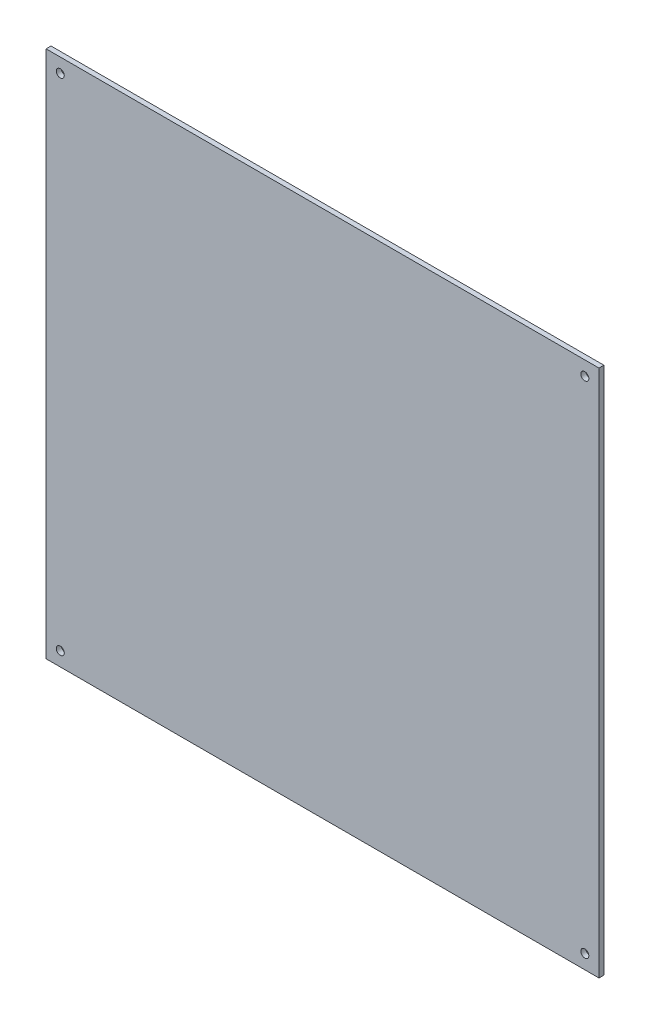
ISO-10303-21;
HEADER;
FILE_DESCRIPTION(('STEP AP214'),'2;1');
FILE_NAME('part.step','',(''),(''),'','','');
FILE_SCHEMA(('AUTOMOTIVE_DESIGN { 1 0 10303 214 1 1 1 1 }'));
ENDSEC;
DATA;
#1=APPLICATION_CONTEXT('core data for automotive mechanical design processes');
#2=APPLICATION_PROTOCOL_DEFINITION('international standard','automotive_design',2000,#1);
#3=PRODUCT_CONTEXT('',#1,'mechanical');
#4=PRODUCT('Part','Part','',(#3));
#5=PRODUCT_RELATED_PRODUCT_CATEGORY('part','',(#4));
#6=PRODUCT_DEFINITION_FORMATION('','',#4);
#7=PRODUCT_DEFINITION_CONTEXT('part definition',#1,'design');
#8=PRODUCT_DEFINITION('design','',#6,#7);
#9=PRODUCT_DEFINITION_SHAPE('','',#8);
#10=(LENGTH_UNIT() NAMED_UNIT(*) SI_UNIT(.MILLI.,.METRE.));
#11=(NAMED_UNIT(*) PLANE_ANGLE_UNIT() SI_UNIT($,.RADIAN.));
#12=(NAMED_UNIT(*) SI_UNIT($,.STERADIAN.) SOLID_ANGLE_UNIT());
#13=UNCERTAINTY_MEASURE_WITH_UNIT(LENGTH_MEASURE(1.E-05),#10,'distance_accuracy_value','');
#14=(GEOMETRIC_REPRESENTATION_CONTEXT(3) GLOBAL_UNCERTAINTY_ASSIGNED_CONTEXT((#13)) GLOBAL_UNIT_ASSIGNED_CONTEXT((#10,
#11,#12)) REPRESENTATION_CONTEXT('',''));
#15=CARTESIAN_POINT('',(0.,0.,0.));
#16=DIRECTION('',(0.,0.,1.));
#17=DIRECTION('',(1.,0.,0.));
#18=AXIS2_PLACEMENT_3D('',#15,#16,#17);
#19=CARTESIAN_POINT('',(0.,0.,4.));
#20=DIRECTION('',(0.,0.,1.));
#21=DIRECTION('',(1.,0.,0.));
#22=AXIS2_PLACEMENT_3D('',#19,#20,#21);
#23=PLANE('',#22);
#24=CARTESIAN_POINT('',(-437.5,11.5000000000001,4.));
#25=DIRECTION('',(0.,0.,1.));
#26=DIRECTION('',(-1.,0.,0.));
#27=AXIS2_PLACEMENT_3D('',#24,#25,#26);
#28=CIRCLE('',#27,3.24999999999995);
#29=CARTESIAN_POINT('',(-440.75,11.5000000000001,4.));
#30=VERTEX_POINT('',#29);
#31=EDGE_CURVE('E161',#30,#30,#28,.T.);
#32=ORIENTED_EDGE('',*,*,#31,.F.);
#33=EDGE_LOOP('',(#32));
#34=FACE_BOUND('',#33,.T.);
#35=CARTESIAN_POINT('',(-437.5,417.5,4.));
#36=DIRECTION('',(0.,0.,1.));
#37=DIRECTION('',(1.,0.,0.));
#38=AXIS2_PLACEMENT_3D('',#35,#36,#37);
#39=CIRCLE('',#38,3.24999999999995);
#40=CARTESIAN_POINT('',(-434.25,417.5,4.));
#41=VERTEX_POINT('',#40);
#42=EDGE_CURVE('E120',#41,#41,#39,.T.);
#43=ORIENTED_EDGE('',*,*,#42,.F.);
#44=EDGE_LOOP('',(#43));
#45=FACE_BOUND('',#44,.T.);
#46=DIRECTION('',(0.,1.,0.));
#47=VECTOR('',#46,1.);
#48=CARTESIAN_POINT('',(0.,0.,4.));
#49=LINE('',#48,#47);
#50=CARTESIAN_POINT('',(0.,0.,4.));
#51=VERTEX_POINT('',#50);
#52=CARTESIAN_POINT('',(-1.66533453693773E-13,429.,4.));
#53=VERTEX_POINT('',#52);
#54=EDGE_CURVE('E100',#51,#53,#49,.T.);
#55=ORIENTED_EDGE('',*,*,#54,.T.);
#56=DIRECTION('',(-1.,0.,0.));
#57=VECTOR('',#56,1.);
#58=CARTESIAN_POINT('',(-1.66533453693773E-13,429.,4.));
#59=LINE('',#58,#57);
#60=CARTESIAN_POINT('',(-449.,429.,4.));
#61=VERTEX_POINT('',#60);
#62=EDGE_CURVE('E94',#53,#61,#59,.T.);
#63=ORIENTED_EDGE('',*,*,#62,.T.);
#64=DIRECTION('',(0.,-1.,0.));
#65=VECTOR('',#64,1.);
#66=CARTESIAN_POINT('',(-449.,0.,4.));
#67=LINE('',#66,#65);
#68=CARTESIAN_POINT('',(-449.,0.,4.));
#69=VERTEX_POINT('',#68);
#70=EDGE_CURVE('E98',#61,#69,#67,.T.);
#71=ORIENTED_EDGE('',*,*,#70,.T.);
#72=DIRECTION('',(1.,0.,0.));
#73=VECTOR('',#72,1.);
#74=CARTESIAN_POINT('',(0.,0.,4.));
#75=LINE('',#74,#73);
#76=EDGE_CURVE('E63',#69,#51,#75,.T.);
#77=ORIENTED_EDGE('',*,*,#76,.T.);
#78=EDGE_LOOP('',(#55,#63,#71,#77));
#79=FACE_BOUND('',#78,.T.);
#80=CARTESIAN_POINT('',(-11.5000000000001,417.5,4.));
#81=DIRECTION('',(0.,0.,1.));
#82=DIRECTION('',(-1.,0.,0.));
#83=AXIS2_PLACEMENT_3D('',#80,#81,#82);
#84=CIRCLE('',#83,3.25);
#85=CARTESIAN_POINT('',(-14.7500000000001,417.5,4.));
#86=VERTEX_POINT('',#85);
#87=EDGE_CURVE('E142',#86,#86,#84,.T.);
#88=ORIENTED_EDGE('',*,*,#87,.F.);
#89=EDGE_LOOP('',(#88));
#90=FACE_BOUND('',#89,.T.);
#91=CARTESIAN_POINT('',(-11.5000000000001,11.5000000000002,4.));
#92=DIRECTION('',(0.,0.,1.));
#93=DIRECTION('',(1.,0.,0.));
#94=AXIS2_PLACEMENT_3D('',#91,#92,#93);
#95=CIRCLE('',#94,3.25);
#96=CARTESIAN_POINT('',(-8.25000000000012,11.5000000000002,4.));
#97=VERTEX_POINT('',#96);
#98=EDGE_CURVE('E162',#97,#97,#95,.T.);
#99=ORIENTED_EDGE('',*,*,#98,.F.);
#100=EDGE_LOOP('',(#99));
#101=FACE_BOUND('',#100,.T.);
#102=ADVANCED_FACE('F45',(#34,#45,#79,#90,#101),#23,.T.);
#103=CARTESIAN_POINT('',(0.,0.,0.));
#104=DIRECTION('',(0.,0.,1.));
#105=DIRECTION('',(1.,0.,0.));
#106=AXIS2_PLACEMENT_3D('',#103,#104,#105);
#107=PLANE('',#106);
#108=DIRECTION('',(0.,1.,0.));
#109=VECTOR('',#108,1.);
#110=CARTESIAN_POINT('',(0.,0.,0.));
#111=LINE('',#110,#109);
#112=CARTESIAN_POINT('',(0.,0.,0.));
#113=VERTEX_POINT('',#112);
#114=CARTESIAN_POINT('',(-1.66533453693773E-13,429.,0.));
#115=VERTEX_POINT('',#114);
#116=EDGE_CURVE('E116',#113,#115,#111,.T.);
#117=ORIENTED_EDGE('',*,*,#116,.F.);
#118=DIRECTION('',(1.,0.,0.));
#119=VECTOR('',#118,1.);
#120=CARTESIAN_POINT('',(0.,0.,0.));
#121=LINE('',#120,#119);
#122=CARTESIAN_POINT('',(-449.,0.,0.));
#123=VERTEX_POINT('',#122);
#124=EDGE_CURVE('E87',#123,#113,#121,.T.);
#125=ORIENTED_EDGE('',*,*,#124,.F.);
#126=DIRECTION('',(0.,-1.,0.));
#127=VECTOR('',#126,1.);
#128=CARTESIAN_POINT('',(-449.,0.,0.));
#129=LINE('',#128,#127);
#130=CARTESIAN_POINT('',(-449.,429.,0.));
#131=VERTEX_POINT('',#130);
#132=EDGE_CURVE('E81',#131,#123,#129,.T.);
#133=ORIENTED_EDGE('',*,*,#132,.F.);
#134=DIRECTION('',(-1.,0.,0.));
#135=VECTOR('',#134,1.);
#136=CARTESIAN_POINT('',(-1.66533453693773E-13,429.,0.));
#137=LINE('',#136,#135);
#138=EDGE_CURVE('E105',#115,#131,#137,.T.);
#139=ORIENTED_EDGE('',*,*,#138,.F.);
#140=EDGE_LOOP('',(#117,#125,#133,#139));
#141=FACE_BOUND('',#140,.T.);
#142=CARTESIAN_POINT('',(-437.5,417.5,0.));
#143=DIRECTION('',(0.,0.,1.));
#144=DIRECTION('',(1.,0.,0.));
#145=AXIS2_PLACEMENT_3D('',#142,#143,#144);
#146=CIRCLE('',#145,3.24999999999995);
#147=CARTESIAN_POINT('',(-434.25,417.5,0.));
#148=VERTEX_POINT('',#147);
#149=EDGE_CURVE('E138',#148,#148,#146,.T.);
#150=ORIENTED_EDGE('',*,*,#149,.T.);
#151=EDGE_LOOP('',(#150));
#152=FACE_BOUND('',#151,.T.);
#153=CARTESIAN_POINT('',(-11.5000000000001,417.5,0.));
#154=DIRECTION('',(0.,0.,1.));
#155=DIRECTION('',(-1.,0.,0.));
#156=AXIS2_PLACEMENT_3D('',#153,#154,#155);
#157=CIRCLE('',#156,3.25);
#158=CARTESIAN_POINT('',(-14.7500000000001,417.5,0.));
#159=VERTEX_POINT('',#158);
#160=EDGE_CURVE('E147',#159,#159,#157,.T.);
#161=ORIENTED_EDGE('',*,*,#160,.T.);
#162=EDGE_LOOP('',(#161));
#163=FACE_BOUND('',#162,.T.);
#164=CARTESIAN_POINT('',(-437.5,11.5000000000001,0.));
#165=DIRECTION('',(0.,0.,1.));
#166=DIRECTION('',(-1.,0.,0.));
#167=AXIS2_PLACEMENT_3D('',#164,#165,#166);
#168=CIRCLE('',#167,3.24999999999995);
#169=CARTESIAN_POINT('',(-440.75,11.5000000000001,0.));
#170=VERTEX_POINT('',#169);
#171=EDGE_CURVE('E158',#170,#170,#168,.T.);
#172=ORIENTED_EDGE('',*,*,#171,.T.);
#173=EDGE_LOOP('',(#172));
#174=FACE_BOUND('',#173,.T.);
#175=CARTESIAN_POINT('',(-11.5000000000001,11.5000000000002,0.));
#176=DIRECTION('',(0.,0.,1.));
#177=DIRECTION('',(1.,0.,0.));
#178=AXIS2_PLACEMENT_3D('',#175,#176,#177);
#179=CIRCLE('',#178,3.25);
#180=CARTESIAN_POINT('',(-8.25000000000012,11.5000000000002,0.));
#181=VERTEX_POINT('',#180);
#182=EDGE_CURVE('E167',#181,#181,#179,.T.);
#183=ORIENTED_EDGE('',*,*,#182,.T.);
#184=EDGE_LOOP('',(#183));
#185=FACE_BOUND('',#184,.T.);
#186=ADVANCED_FACE('F133',(#141,#152,#163,#174,#185),#107,.F.);
#187=CARTESIAN_POINT('',(0.,0.,4.));
#188=DIRECTION('',(-1.,0.,0.));
#189=DIRECTION('',(0.,-1.,0.));
#190=AXIS2_PLACEMENT_3D('',#187,#188,#189);
#191=PLANE('',#190);
#192=ORIENTED_EDGE('',*,*,#116,.T.);
#193=DIRECTION('',(0.,0.,-1.));
#194=VECTOR('',#193,1.);
#195=CARTESIAN_POINT('',(-1.66533453693773E-13,429.,4.));
#196=LINE('',#195,#194);
#197=EDGE_CURVE('E12',#53,#115,#196,.T.);
#198=ORIENTED_EDGE('',*,*,#197,.F.);
#199=ORIENTED_EDGE('',*,*,#54,.F.);
#200=DIRECTION('',(0.,0.,-1.));
#201=VECTOR('',#200,1.);
#202=CARTESIAN_POINT('',(0.,0.,4.));
#203=LINE('',#202,#201);
#204=EDGE_CURVE('E112',#51,#113,#203,.T.);
#205=ORIENTED_EDGE('',*,*,#204,.T.);
#206=EDGE_LOOP('',(#192,#198,#199,#205));
#207=FACE_BOUND('',#206,.T.);
#208=ADVANCED_FACE('F47',(#207),#191,.F.);
#209=CARTESIAN_POINT('',(-1.66533453693773E-13,429.,4.));
#210=DIRECTION('',(0.,-1.,0.));
#211=DIRECTION('',(1.,0.,0.));
#212=AXIS2_PLACEMENT_3D('',#209,#210,#211);
#213=PLANE('',#212);
#214=ORIENTED_EDGE('',*,*,#138,.T.);
#215=DIRECTION('',(0.,0.,-1.));
#216=VECTOR('',#215,1.);
#217=CARTESIAN_POINT('',(-449.,429.,4.));
#218=LINE('',#217,#216);
#219=EDGE_CURVE('E55',#61,#131,#218,.T.);
#220=ORIENTED_EDGE('',*,*,#219,.F.);
#221=ORIENTED_EDGE('',*,*,#62,.F.);
#222=ORIENTED_EDGE('',*,*,#197,.T.);
#223=EDGE_LOOP('',(#214,#220,#221,#222));
#224=FACE_BOUND('',#223,.T.);
#225=ADVANCED_FACE('F104',(#224),#213,.F.);
#226=CARTESIAN_POINT('',(-449.,0.,4.));
#227=DIRECTION('',(1.,0.,0.));
#228=DIRECTION('',(0.,1.,0.));
#229=AXIS2_PLACEMENT_3D('',#226,#227,#228);
#230=PLANE('',#229);
#231=ORIENTED_EDGE('',*,*,#132,.T.);
#232=DIRECTION('',(0.,0.,-1.));
#233=VECTOR('',#232,1.);
#234=CARTESIAN_POINT('',(-449.,0.,4.));
#235=LINE('',#234,#233);
#236=EDGE_CURVE('E107',#69,#123,#235,.T.);
#237=ORIENTED_EDGE('',*,*,#236,.F.);
#238=ORIENTED_EDGE('',*,*,#70,.F.);
#239=ORIENTED_EDGE('',*,*,#219,.T.);
#240=EDGE_LOOP('',(#231,#237,#238,#239));
#241=FACE_BOUND('',#240,.T.);
#242=ADVANCED_FACE('F108',(#241),#230,.F.);
#243=CARTESIAN_POINT('',(0.,0.,4.));
#244=DIRECTION('',(0.,1.,0.));
#245=DIRECTION('',(-1.,0.,0.));
#246=AXIS2_PLACEMENT_3D('',#243,#244,#245);
#247=PLANE('',#246);
#248=ORIENTED_EDGE('',*,*,#124,.T.);
#249=ORIENTED_EDGE('',*,*,#204,.F.);
#250=ORIENTED_EDGE('',*,*,#76,.F.);
#251=ORIENTED_EDGE('',*,*,#236,.T.);
#252=EDGE_LOOP('',(#248,#249,#250,#251));
#253=FACE_BOUND('',#252,.T.);
#254=ADVANCED_FACE('F130',(#253),#247,.F.);
#255=CARTESIAN_POINT('',(-437.5,417.5,4.));
#256=DIRECTION('',(0.,0.,-1.));
#257=DIRECTION('',(-1.,0.,0.));
#258=AXIS2_PLACEMENT_3D('',#255,#256,#257);
#259=CYLINDRICAL_SURFACE('',#258,3.24999999999995);
#260=ORIENTED_EDGE('',*,*,#42,.T.);
#261=EDGE_LOOP('',(#260));
#262=FACE_BOUND('',#261,.T.);
#263=ORIENTED_EDGE('',*,*,#149,.F.);
#264=EDGE_LOOP('',(#263));
#265=FACE_BOUND('',#264,.T.);
#266=ADVANCED_FACE('F188',(#262,#265),#259,.F.);
#267=CARTESIAN_POINT('',(-11.5000000000001,417.5,4.));
#268=DIRECTION('',(0.,0.,-1.));
#269=DIRECTION('',(-1.,0.,0.));
#270=AXIS2_PLACEMENT_3D('',#267,#268,#269);
#271=CYLINDRICAL_SURFACE('',#270,3.25);
#272=ORIENTED_EDGE('',*,*,#87,.T.);
#273=EDGE_LOOP('',(#272));
#274=FACE_BOUND('',#273,.T.);
#275=ORIENTED_EDGE('',*,*,#160,.F.);
#276=EDGE_LOOP('',(#275));
#277=FACE_BOUND('',#276,.T.);
#278=ADVANCED_FACE('F209',(#274,#277),#271,.F.);
#279=CARTESIAN_POINT('',(-437.5,11.5000000000001,4.));
#280=DIRECTION('',(0.,0.,-1.));
#281=DIRECTION('',(-1.,0.,0.));
#282=AXIS2_PLACEMENT_3D('',#279,#280,#281);
#283=CYLINDRICAL_SURFACE('',#282,3.24999999999995);
#284=ORIENTED_EDGE('',*,*,#31,.T.);
#285=EDGE_LOOP('',(#284));
#286=FACE_BOUND('',#285,.T.);
#287=ORIENTED_EDGE('',*,*,#171,.F.);
#288=EDGE_LOOP('',(#287));
#289=FACE_BOUND('',#288,.T.);
#290=ADVANCED_FACE('F212',(#286,#289),#283,.F.);
#291=CARTESIAN_POINT('',(-11.5000000000001,11.5000000000002,4.));
#292=DIRECTION('',(0.,0.,-1.));
#293=DIRECTION('',(-1.,0.,0.));
#294=AXIS2_PLACEMENT_3D('',#291,#292,#293);
#295=CYLINDRICAL_SURFACE('',#294,3.25);
#296=ORIENTED_EDGE('',*,*,#98,.T.);
#297=EDGE_LOOP('',(#296));
#298=FACE_BOUND('',#297,.T.);
#299=ORIENTED_EDGE('',*,*,#182,.F.);
#300=EDGE_LOOP('',(#299));
#301=FACE_BOUND('',#300,.T.);
#302=ADVANCED_FACE('F175',(#298,#301),#295,.F.);
#303=CLOSED_SHELL('',(#102,#186,#208,#225,#242,#254,#266,#278,#290,#302));
#304=MANIFOLD_SOLID_BREP('B2',#303);
#305=ADVANCED_BREP_SHAPE_REPRESENTATION('',(#18,#304),#14);
#306=SHAPE_DEFINITION_REPRESENTATION(#9,#305);
ENDSEC;
END-ISO-10303-21;
